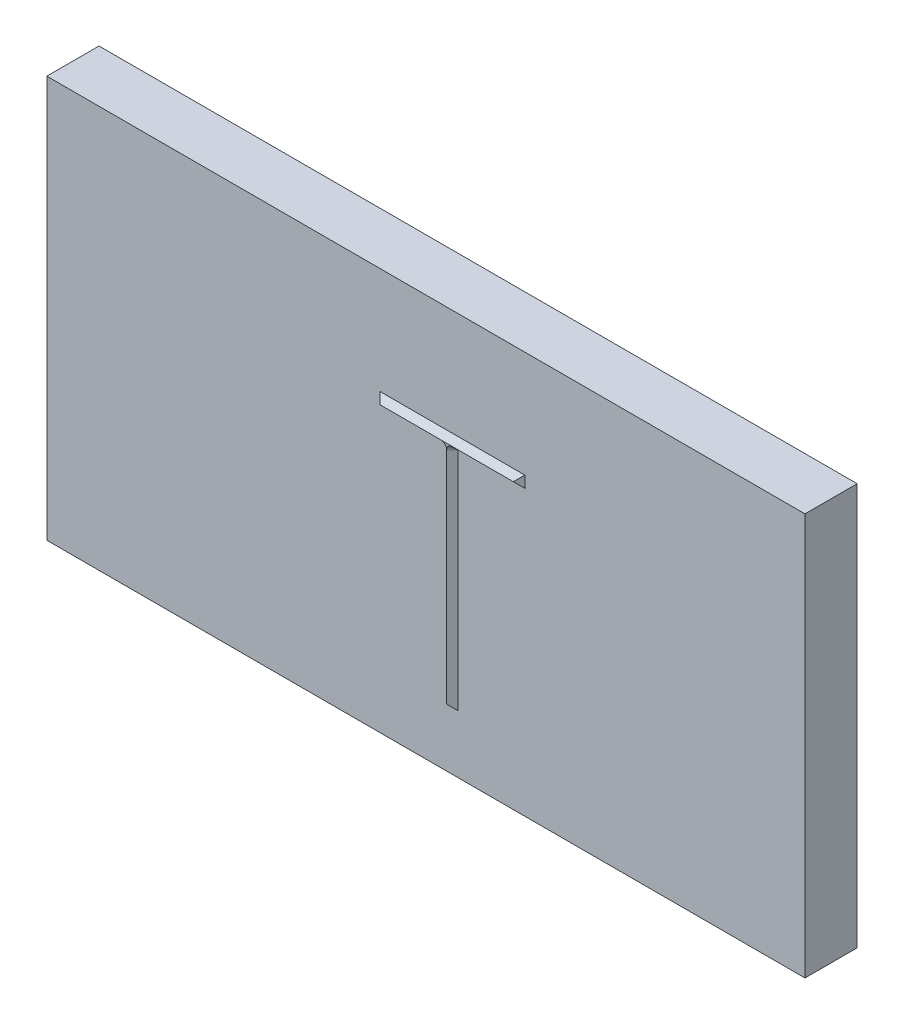
ISO-10303-21;
HEADER;
FILE_DESCRIPTION(('STEP AP214'),'2;1');
FILE_NAME('part.step','',(''),(''),'','','');
FILE_SCHEMA(('AUTOMOTIVE_DESIGN { 1 0 10303 214 1 1 1 1 }'));
ENDSEC;
DATA;
#1=APPLICATION_CONTEXT('core data for automotive mechanical design processes');
#2=APPLICATION_PROTOCOL_DEFINITION('international standard','automotive_design',2000,#1);
#3=PRODUCT_CONTEXT('',#1,'mechanical');
#4=PRODUCT('Part','Part','',(#3));
#5=PRODUCT_RELATED_PRODUCT_CATEGORY('part','',(#4));
#6=PRODUCT_DEFINITION_FORMATION('','',#4);
#7=PRODUCT_DEFINITION_CONTEXT('part definition',#1,'design');
#8=PRODUCT_DEFINITION('design','',#6,#7);
#9=PRODUCT_DEFINITION_SHAPE('','',#8);
#10=(LENGTH_UNIT() NAMED_UNIT(*) SI_UNIT(.MILLI.,.METRE.));
#11=(NAMED_UNIT(*) PLANE_ANGLE_UNIT() SI_UNIT($,.RADIAN.));
#12=(NAMED_UNIT(*) SI_UNIT($,.STERADIAN.) SOLID_ANGLE_UNIT());
#13=UNCERTAINTY_MEASURE_WITH_UNIT(LENGTH_MEASURE(1.E-05),#10,'distance_accuracy_value','');
#14=(GEOMETRIC_REPRESENTATION_CONTEXT(3) GLOBAL_UNCERTAINTY_ASSIGNED_CONTEXT((#13)) GLOBAL_UNIT_ASSIGNED_CONTEXT((#10,
#11,#12)) REPRESENTATION_CONTEXT('',''));
#15=CARTESIAN_POINT('',(0.,0.,0.));
#16=DIRECTION('',(0.,0.,1.));
#17=DIRECTION('',(1.,0.,0.));
#18=AXIS2_PLACEMENT_3D('',#15,#16,#17);
#19=CARTESIAN_POINT('',(69.01,10.,9.01));
#20=DIRECTION('',(0.707106781186551,0.,-0.707106781186544));
#21=DIRECTION('',(-0.707106781186544,0.,-0.707106781186551));
#22=AXIS2_PLACEMENT_3D('',#19,#20,#21);
#23=PLANE('',#22);
#24=DIRECTION('',(-0.577350269189624,-0.577350269189624,-0.57735026918963));
#25=VECTOR('',#24,1.);
#26=CARTESIAN_POINT('',(69.0066666666667,10.0066666666667,9.00666666666666));
#27=LINE('',#26,#25);
#28=CARTESIAN_POINT('',(70.,11.,10.));
#29=VERTEX_POINT('',#28);
#30=CARTESIAN_POINT('',(69.01,10.01,9.01));
#31=VERTEX_POINT('',#30);
#32=EDGE_CURVE('E405',#29,#31,#27,.T.);
#33=ORIENTED_EDGE('',*,*,#32,.F.);
#34=DIRECTION('',(0.,1.,0.));
#35=VECTOR('',#34,1.);
#36=CARTESIAN_POINT('',(70.,10.,10.));
#37=LINE('',#36,#35);
#38=CARTESIAN_POINT('',(70.,49.,10.));
#39=VERTEX_POINT('',#38);
#40=EDGE_CURVE('E322',#29,#39,#37,.T.);
#41=ORIENTED_EDGE('',*,*,#40,.T.);
#42=CARTESIAN_POINT('',(70.,49.,10.));
#43=DIRECTION('',(-0.707106781186544,0.,-0.707106781186551));
#44=VECTOR('',#43,1.);
#45=LINE('',#42,#44);
#46=CARTESIAN_POINT('',(69.01,49.,9.01));
#47=VERTEX_POINT('',#46);
#48=EDGE_CURVE('E441',#39,#47,#45,.T.);
#49=ORIENTED_EDGE('',*,*,#48,.T.);
#50=DIRECTION('',(0.,1.,0.));
#51=VECTOR('',#50,1.);
#52=CARTESIAN_POINT('',(69.01,10.,9.01));
#53=LINE('',#52,#51);
#54=EDGE_CURVE('E95',#31,#47,#53,.T.);
#55=ORIENTED_EDGE('',*,*,#54,.F.);
#56=EDGE_LOOP('',(#33,#41,#49,#55));
#57=FACE_BOUND('',#56,.T.);
#58=ADVANCED_FACE('F91',(#57),#23,.F.);
#59=CARTESIAN_POINT('',(70.99,10.,9.01));
#60=DIRECTION('',(0.707106781186551,0.,0.707106781186544));
#61=DIRECTION('',(0.707106781186544,0.,-0.707106781186551));
#62=AXIS2_PLACEMENT_3D('',#59,#60,#61);
#63=PLANE('',#62);
#64=ORIENTED_EDGE('',*,*,#40,.F.);
#65=DIRECTION('',(0.577350269189624,-0.577350269189624,-0.57735026918963));
#66=VECTOR('',#65,1.);
#67=CARTESIAN_POINT('',(70.9933333333333,10.0066666666667,9.00666666666666));
#68=LINE('',#67,#66);
#69=CARTESIAN_POINT('',(70.99,10.01,9.01));
#70=VERTEX_POINT('',#69);
#71=EDGE_CURVE('E13',#29,#70,#68,.T.);
#72=ORIENTED_EDGE('',*,*,#71,.T.);
#73=DIRECTION('',(0.,1.,0.));
#74=VECTOR('',#73,1.);
#75=CARTESIAN_POINT('',(70.99,10.,9.01));
#76=LINE('',#75,#74);
#77=CARTESIAN_POINT('',(70.99,49.,9.01));
#78=VERTEX_POINT('',#77);
#79=EDGE_CURVE('E324',#70,#78,#76,.T.);
#80=ORIENTED_EDGE('',*,*,#79,.T.);
#81=CARTESIAN_POINT('',(70.,48.9999999999977,10.));
#82=DIRECTION('',(0.707106781186544,1.62064467799746E-12,-0.707106781186551));
#83=VECTOR('',#82,1.);
#84=LINE('',#81,#83);
#85=EDGE_CURVE('E326',#39,#78,#84,.T.);
#86=ORIENTED_EDGE('',*,*,#85,.F.);
#87=EDGE_LOOP('',(#64,#72,#80,#86));
#88=FACE_BOUND('',#87,.T.);
#89=ADVANCED_FACE('F237',(#88),#63,.T.);
#90=CARTESIAN_POINT('',(0.,0.,10.));
#91=DIRECTION('',(0.,0.,-1.));
#92=DIRECTION('',(-1.,0.,0.));
#93=AXIS2_PLACEMENT_3D('',#90,#91,#92);
#94=PLANE('',#93);
#95=CARTESIAN_POINT('',(71.,49.,10.));
#96=DIRECTION('',(0.,0.,1.));
#97=DIRECTION('',(-5.00129789388072E-05,0.999999998749351,0.));
#98=AXIS2_PLACEMENT_3D('',#95,#96,#97);
#99=CIRCLE('',#98,0.999999999999998);
#100=CARTESIAN_POINT('',(70.9999749935106,50.,10.));
#101=VERTEX_POINT('',#100);
#102=EDGE_CURVE('E259',#101,#39,#99,.T.);
#103=ORIENTED_EDGE('',*,*,#102,.F.);
#104=DIRECTION('',(1.,0.,0.));
#105=VECTOR('',#104,1.);
#106=CARTESIAN_POINT('',(57.5,50.,10.));
#107=LINE('',#106,#105);
#108=CARTESIAN_POINT('',(68.9998884489562,50.,10.));
#109=VERTEX_POINT('',#108);
#110=EDGE_CURVE('E413',#109,#101,#107,.T.);
#111=ORIENTED_EDGE('',*,*,#110,.F.);
#112=CARTESIAN_POINT('',(69.,49.,10.));
#113=DIRECTION('',(0.,0.,1.));
#114=DIRECTION('',(1.,0.,0.));
#115=AXIS2_PLACEMENT_3D('',#112,#113,#114);
#116=CIRCLE('',#115,1.);
#117=EDGE_CURVE('E219',#39,#109,#116,.T.);
#118=ORIENTED_EDGE('',*,*,#117,.F.);
#119=EDGE_LOOP('',(#103,#111,#118));
#120=FACE_BOUND('',#119,.T.);
#121=ADVANCED_FACE('F226',(#120),#94,.F.);
#122=CARTESIAN_POINT('',(71.,49.01,9.01));
#123=DIRECTION('',(0.,-0.707106781186551,0.707106781186544));
#124=DIRECTION('',(0.,-0.707106781186544,-0.707106781186551));
#125=AXIS2_PLACEMENT_3D('',#122,#123,#124);
#126=PLANE('',#125);
#127=DIRECTION('',(1.,0.,0.));
#128=VECTOR('',#127,1.);
#129=CARTESIAN_POINT('',(71.,49.01,9.01));
#130=LINE('',#129,#128);
#131=CARTESIAN_POINT('',(71.,49.01,9.01));
#132=VERTEX_POINT('',#131);
#133=CARTESIAN_POINT('',(82.49,49.01,9.01));
#134=VERTEX_POINT('',#133);
#135=EDGE_CURVE('E423',#132,#134,#130,.T.);
#136=ORIENTED_EDGE('',*,*,#135,.T.);
#137=DIRECTION('',(-0.577350269189624,0.577350269189624,0.57735026918963));
#138=VECTOR('',#137,1.);
#139=CARTESIAN_POINT('',(78.66,52.84,12.84));
#140=LINE('',#139,#138);
#141=CARTESIAN_POINT('',(81.5,50.,10.));
#142=VERTEX_POINT('',#141);
#143=EDGE_CURVE('E207',#134,#142,#140,.T.);
#144=ORIENTED_EDGE('',*,*,#143,.T.);
#145=DIRECTION('',(1.,0.,0.));
#146=VECTOR('',#145,1.);
#147=CARTESIAN_POINT('',(71.,50.,10.));
#148=LINE('',#147,#146);
#149=EDGE_CURVE('E424',#101,#142,#148,.T.);
#150=ORIENTED_EDGE('',*,*,#149,.F.);
#151=CARTESIAN_POINT('',(71.,50.,10.));
#152=DIRECTION('',(0.,-0.707106781186544,-0.707106781186551));
#153=VECTOR('',#152,1.);
#154=LINE('',#151,#153);
#155=EDGE_CURVE('E116',#101,#132,#154,.T.);
#156=ORIENTED_EDGE('',*,*,#155,.T.);
#157=EDGE_LOOP('',(#136,#144,#150,#156));
#158=FACE_BOUND('',#157,.T.);
#159=ADVANCED_FACE('F236',(#158),#126,.T.);
#160=CARTESIAN_POINT('',(71.,49.,10.));
#161=DIRECTION('',(0.,0.,1.));
#162=DIRECTION('',(0.,-1.,0.));
#163=AXIS2_PLACEMENT_3D('',#160,#161,#162);
#164=CONICAL_SURFACE('',#163,1.,0.785398163397444);
#165=CARTESIAN_POINT('',(70.99,49.,9.01));
#166=CARTESIAN_POINT('',(70.99,48.98,9.01));
#167=CARTESIAN_POINT('',(71.01,48.98,9.01));
#168=CARTESIAN_POINT('',(71.01,49.,9.01));
#169=CARTESIAN_POINT('',(71.01,49.02,9.01));
#170=CARTESIAN_POINT('',(70.99,49.02,9.01));
#171=CARTESIAN_POINT('',(70.99,49.,9.01));
#172=(BOUNDED_CURVE() B_SPLINE_CURVE(3,(#165,#166,#167,#168,#169,#170,#171),.UNSPECIFIED.,.T.,
.F.) B_SPLINE_CURVE_WITH_KNOTS((4,3,4),(0.,0.5,1.),
.UNSPECIFIED.) CURVE() GEOMETRIC_REPRESENTATION_ITEM() RATIONAL_B_SPLINE_CURVE((1.,
0.333333333333333,0.333333333333333,1.,0.333333333333333,0.333333333333333,1.)) REPRESENTATION_ITEM(''));
#173=EDGE_CURVE('E248',#132,#78,#172,.T.);
#174=ORIENTED_EDGE('',*,*,#173,.F.);
#175=ORIENTED_EDGE('',*,*,#155,.F.);
#176=ORIENTED_EDGE('',*,*,#102,.T.);
#177=ORIENTED_EDGE('',*,*,#85,.T.);
#178=EDGE_LOOP('',(#174,#175,#176,#177));
#179=FACE_BOUND('',#178,.T.);
#180=ADVANCED_FACE('F269',(#179),#164,.F.);
#181=CARTESIAN_POINT('',(69.,49.,10.));
#182=DIRECTION('',(0.,0.,1.));
#183=DIRECTION('',(0.,-1.,0.));
#184=AXIS2_PLACEMENT_3D('',#181,#182,#183);
#185=CONICAL_SURFACE('',#184,1.,0.785398163397444);
#186=CARTESIAN_POINT('',(69.,50.,10.));
#187=DIRECTION('',(0.,-0.707106781186545,-0.70710678118655));
#188=VECTOR('',#187,1.);
#189=LINE('',#186,#188);
#190=CARTESIAN_POINT('',(69.,49.01,9.01));
#191=VERTEX_POINT('',#190);
#192=EDGE_CURVE('E314',#109,#191,#189,.T.);
#193=ORIENTED_EDGE('',*,*,#192,.T.);
#194=CARTESIAN_POINT('',(69.01,49.,9.01));
#195=CARTESIAN_POINT('',(69.01,49.02,9.01));
#196=CARTESIAN_POINT('',(68.99,49.02,9.01));
#197=CARTESIAN_POINT('',(68.99,49.,9.01));
#198=CARTESIAN_POINT('',(68.99,48.98,9.01));
#199=CARTESIAN_POINT('',(69.01,48.98,9.01));
#200=CARTESIAN_POINT('',(69.01,49.,9.01));
#201=(BOUNDED_CURVE() B_SPLINE_CURVE(3,(#194,#195,#196,#197,#198,#199,#200),.UNSPECIFIED.,.T.,
.F.) B_SPLINE_CURVE_WITH_KNOTS((4,3,4),(0.,0.5,1.),
.UNSPECIFIED.) CURVE() GEOMETRIC_REPRESENTATION_ITEM() RATIONAL_B_SPLINE_CURVE((1.,
0.333333333333333,0.333333333333333,1.,0.333333333333333,0.333333333333333,1.)) REPRESENTATION_ITEM(''));
#202=EDGE_CURVE('E445',#47,#191,#201,.T.);
#203=ORIENTED_EDGE('',*,*,#202,.F.);
#204=ORIENTED_EDGE('',*,*,#48,.F.);
#205=ORIENTED_EDGE('',*,*,#117,.T.);
#206=EDGE_LOOP('',(#193,#203,#204,#205));
#207=FACE_BOUND('',#206,.T.);
#208=ADVANCED_FACE('F238',(#207),#185,.F.);
#209=CARTESIAN_POINT('',(69.,10.,9.01));
#210=DIRECTION('',(0.,0.,1.));
#211=DIRECTION('',(1.,0.,0.));
#212=AXIS2_PLACEMENT_3D('',#209,#210,#211);
#213=PLANE('',#212);
#214=DIRECTION('',(1.,0.,0.));
#215=VECTOR('',#214,1.);
#216=CARTESIAN_POINT('',(69.,10.01,9.01));
#217=LINE('',#216,#215);
#218=EDGE_CURVE('E191',#31,#70,#217,.T.);
#219=ORIENTED_EDGE('',*,*,#218,.F.);
#220=ORIENTED_EDGE('',*,*,#54,.T.);
#221=ORIENTED_EDGE('',*,*,#202,.T.);
#222=DIRECTION('',(-1.,0.,0.));
#223=VECTOR('',#222,1.);
#224=CARTESIAN_POINT('',(69.,49.01,9.01));
#225=LINE('',#224,#223);
#226=CARTESIAN_POINT('',(57.51,49.01,9.01));
#227=VERTEX_POINT('',#226);
#228=EDGE_CURVE('E305',#191,#227,#225,.T.);
#229=ORIENTED_EDGE('',*,*,#228,.T.);
#230=DIRECTION('',(0.,1.,0.));
#231=VECTOR('',#230,1.);
#232=CARTESIAN_POINT('',(57.51,49.,9.01));
#233=LINE('',#232,#231);
#234=CARTESIAN_POINT('',(57.51,50.99,9.01));
#235=VERTEX_POINT('',#234);
#236=EDGE_CURVE('E302',#227,#235,#233,.T.);
#237=ORIENTED_EDGE('',*,*,#236,.T.);
#238=DIRECTION('',(1.,0.,0.));
#239=VECTOR('',#238,1.);
#240=CARTESIAN_POINT('',(57.5,50.99,9.01));
#241=LINE('',#240,#239);
#242=CARTESIAN_POINT('',(82.49,50.99,9.01));
#243=VERTEX_POINT('',#242);
#244=EDGE_CURVE('E407',#235,#243,#241,.T.);
#245=ORIENTED_EDGE('',*,*,#244,.T.);
#246=DIRECTION('',(0.,1.,0.));
#247=VECTOR('',#246,1.);
#248=CARTESIAN_POINT('',(82.49,49.,9.01));
#249=LINE('',#248,#247);
#250=EDGE_CURVE('E418',#134,#243,#249,.T.);
#251=ORIENTED_EDGE('',*,*,#250,.F.);
#252=ORIENTED_EDGE('',*,*,#135,.F.);
#253=ORIENTED_EDGE('',*,*,#173,.T.);
#254=ORIENTED_EDGE('',*,*,#79,.F.);
#255=EDGE_LOOP('',(#219,#220,#221,#229,#237,#245,#251,#252,#253,#254));
#256=FACE_BOUND('',#255,.T.);
#257=DIRECTION('',(1.,0.,0.));
#258=VECTOR('',#257,1.);
#259=CARTESIAN_POINT('',(130.844862561268,69.372082704697,9.00999999999999));
#260=LINE('',#259,#258);
#261=CARTESIAN_POINT('',(0.,69.372082704697,9.00999999999999));
#262=VERTEX_POINT('',#261);
#263=CARTESIAN_POINT('',(130.844862561268,69.372082704697,9.01));
#264=VERTEX_POINT('',#263);
#265=EDGE_CURVE('E187',#262,#264,#260,.T.);
#266=ORIENTED_EDGE('',*,*,#265,.F.);
#267=DIRECTION('',(0.,1.,0.));
#268=VECTOR('',#267,1.);
#269=CARTESIAN_POINT('',(0.,69.372082704697,9.00999999999999));
#270=LINE('',#269,#268);
#271=CARTESIAN_POINT('',(0.,0.,9.00999999999999));
#272=VERTEX_POINT('',#271);
#273=EDGE_CURVE('E183',#272,#262,#270,.T.);
#274=ORIENTED_EDGE('',*,*,#273,.F.);
#275=DIRECTION('',(-1.,0.,0.));
#276=VECTOR('',#275,1.);
#277=CARTESIAN_POINT('',(0.,0.,9.00999999999999));
#278=LINE('',#277,#276);
#279=CARTESIAN_POINT('',(130.844862561268,0.,9.00999999999999));
#280=VERTEX_POINT('',#279);
#281=EDGE_CURVE('E186',#280,#272,#278,.T.);
#282=ORIENTED_EDGE('',*,*,#281,.F.);
#283=DIRECTION('',(0.,-1.,0.));
#284=VECTOR('',#283,1.);
#285=CARTESIAN_POINT('',(130.844862561268,0.,9.00999999999999));
#286=LINE('',#285,#284);
#287=EDGE_CURVE('E108',#264,#280,#286,.T.);
#288=ORIENTED_EDGE('',*,*,#287,.F.);
#289=EDGE_LOOP('',(#266,#274,#282,#288));
#290=FACE_BOUND('',#289,.T.);
#291=ADVANCED_FACE('F185',(#256,#290),#213,.T.);
#292=CARTESIAN_POINT('',(69.,49.01,9.01));
#293=DIRECTION('',(0.,0.707106781186551,-0.707106781186544));
#294=DIRECTION('',(0.,0.707106781186544,0.707106781186551));
#295=AXIS2_PLACEMENT_3D('',#292,#293,#294);
#296=PLANE('',#295);
#297=DIRECTION('',(-1.,0.,0.));
#298=VECTOR('',#297,1.);
#299=CARTESIAN_POINT('',(69.,50.,10.));
#300=LINE('',#299,#298);
#301=CARTESIAN_POINT('',(58.5,50.,10.));
#302=VERTEX_POINT('',#301);
#303=EDGE_CURVE('E310',#109,#302,#300,.T.);
#304=ORIENTED_EDGE('',*,*,#303,.T.);
#305=DIRECTION('',(-0.577350269189624,-0.577350269189624,-0.57735026918963));
#306=VECTOR('',#305,1.);
#307=CARTESIAN_POINT('',(61.34,52.84,12.84));
#308=LINE('',#307,#306);
#309=EDGE_CURVE('E204',#302,#227,#308,.T.);
#310=ORIENTED_EDGE('',*,*,#309,.T.);
#311=ORIENTED_EDGE('',*,*,#228,.F.);
#312=ORIENTED_EDGE('',*,*,#192,.F.);
#313=EDGE_LOOP('',(#304,#310,#311,#312));
#314=FACE_BOUND('',#313,.T.);
#315=ADVANCED_FACE('F472',(#314),#296,.F.);
#316=CARTESIAN_POINT('',(57.51,49.,9.01));
#317=DIRECTION('',(0.707106781186551,0.,-0.707106781186544));
#318=DIRECTION('',(-0.707106781186544,0.,-0.707106781186551));
#319=AXIS2_PLACEMENT_3D('',#316,#317,#318);
#320=PLANE('',#319);
#321=ORIENTED_EDGE('',*,*,#309,.F.);
#322=DIRECTION('',(-0.577350269189623,0.577350269189626,-0.577350269189629));
#323=VECTOR('',#322,1.);
#324=CARTESIAN_POINT('',(58.1733333333333,50.3266666666667,9.67333333333333));
#325=LINE('',#324,#323);
#326=EDGE_CURVE('E415',#302,#235,#325,.T.);
#327=ORIENTED_EDGE('',*,*,#326,.T.);
#328=ORIENTED_EDGE('',*,*,#236,.F.);
#329=EDGE_LOOP('',(#321,#327,#328));
#330=FACE_BOUND('',#329,.T.);
#331=ADVANCED_FACE('F281',(#330),#320,.F.);
#332=CARTESIAN_POINT('',(82.49,49.,9.01));
#333=DIRECTION('',(0.707106781186551,0.,0.707106781186544));
#334=DIRECTION('',(0.707106781186544,0.,-0.707106781186551));
#335=AXIS2_PLACEMENT_3D('',#332,#333,#334);
#336=PLANE('',#335);
#337=DIRECTION('',(0.577350269189623,0.577350269189626,-0.577350269189629));
#338=VECTOR('',#337,1.);
#339=CARTESIAN_POINT('',(81.8266666666667,50.3266666666667,9.67333333333333));
#340=LINE('',#339,#338);
#341=EDGE_CURVE('E101',#142,#243,#340,.T.);
#342=ORIENTED_EDGE('',*,*,#341,.F.);
#343=ORIENTED_EDGE('',*,*,#143,.F.);
#344=ORIENTED_EDGE('',*,*,#250,.T.);
#345=EDGE_LOOP('',(#342,#343,#344));
#346=FACE_BOUND('',#345,.T.);
#347=ADVANCED_FACE('F346',(#346),#336,.T.);
#348=CARTESIAN_POINT('',(57.5,50.99,9.01));
#349=DIRECTION('',(0.,-0.707106781186549,-0.707106781186546));
#350=DIRECTION('',(0.,0.707106781186546,-0.707106781186549));
#351=AXIS2_PLACEMENT_3D('',#348,#349,#350);
#352=PLANE('',#351);
#353=ORIENTED_EDGE('',*,*,#303,.F.);
#354=ORIENTED_EDGE('',*,*,#110,.T.);
#355=ORIENTED_EDGE('',*,*,#149,.T.);
#356=ORIENTED_EDGE('',*,*,#341,.T.);
#357=ORIENTED_EDGE('',*,*,#244,.F.);
#358=ORIENTED_EDGE('',*,*,#326,.F.);
#359=EDGE_LOOP('',(#353,#354,#355,#356,#357,#358));
#360=FACE_BOUND('',#359,.T.);
#361=ADVANCED_FACE('F349',(#360),#352,.F.);
#362=CARTESIAN_POINT('',(69.,10.01,9.01));
#363=DIRECTION('',(0.,-0.707106781186551,0.707106781186544));
#364=DIRECTION('',(0.,-0.707106781186544,-0.707106781186551));
#365=AXIS2_PLACEMENT_3D('',#362,#363,#364);
#366=PLANE('',#365);
#367=ORIENTED_EDGE('',*,*,#32,.T.);
#368=ORIENTED_EDGE('',*,*,#218,.T.);
#369=ORIENTED_EDGE('',*,*,#71,.F.);
#370=EDGE_LOOP('',(#367,#368,#369));
#371=FACE_BOUND('',#370,.T.);
#372=ADVANCED_FACE('F353',(#371),#366,.T.);
#373=CARTESIAN_POINT('',(0.,0.,0.));
#374=DIRECTION('',(0.,0.,-1.));
#375=DIRECTION('',(-1.,0.,0.));
#376=AXIS2_PLACEMENT_3D('',#373,#374,#375);
#377=PLANE('',#376);
#378=DIRECTION('',(0.,-1.,0.));
#379=VECTOR('',#378,1.);
#380=CARTESIAN_POINT('',(0.,0.,0.));
#381=LINE('',#380,#379);
#382=CARTESIAN_POINT('',(0.,69.372082704697,0.));
#383=VERTEX_POINT('',#382);
#384=CARTESIAN_POINT('',(0.,0.,0.));
#385=VERTEX_POINT('',#384);
#386=EDGE_CURVE('E203',#383,#385,#381,.T.);
#387=ORIENTED_EDGE('',*,*,#386,.F.);
#388=DIRECTION('',(-1.,0.,0.));
#389=VECTOR('',#388,1.);
#390=CARTESIAN_POINT('',(0.,69.372082704697,0.));
#391=LINE('',#390,#389);
#392=CARTESIAN_POINT('',(130.844862561268,69.372082704697,0.));
#393=VERTEX_POINT('',#392);
#394=EDGE_CURVE('E389',#393,#383,#391,.T.);
#395=ORIENTED_EDGE('',*,*,#394,.F.);
#396=DIRECTION('',(0.,1.,0.));
#397=VECTOR('',#396,1.);
#398=CARTESIAN_POINT('',(130.844862561268,0.,0.));
#399=LINE('',#398,#397);
#400=CARTESIAN_POINT('',(130.844862561268,0.,0.));
#401=VERTEX_POINT('',#400);
#402=EDGE_CURVE('E386',#401,#393,#399,.T.);
#403=ORIENTED_EDGE('',*,*,#402,.F.);
#404=DIRECTION('',(1.,0.,0.));
#405=VECTOR('',#404,1.);
#406=CARTESIAN_POINT('',(0.,0.,0.));
#407=LINE('',#406,#405);
#408=EDGE_CURVE('E384',#385,#401,#407,.T.);
#409=ORIENTED_EDGE('',*,*,#408,.F.);
#410=EDGE_LOOP('',(#387,#395,#403,#409));
#411=FACE_BOUND('',#410,.T.);
#412=ADVANCED_FACE('F241',(#411),#377,.T.);
#413=CARTESIAN_POINT('',(0.,69.372082704697,10.));
#414=DIRECTION('',(0.,-1.,0.));
#415=DIRECTION('',(0.,0.,-1.));
#416=AXIS2_PLACEMENT_3D('',#413,#414,#415);
#417=PLANE('',#416);
#418=ORIENTED_EDGE('',*,*,#265,.T.);
#419=DIRECTION('',(0.,0.,-1.));
#420=VECTOR('',#419,1.);
#421=CARTESIAN_POINT('',(130.844862561268,69.372082704697,10.));
#422=LINE('',#421,#420);
#423=EDGE_CURVE('E209',#264,#393,#422,.T.);
#424=ORIENTED_EDGE('',*,*,#423,.T.);
#425=ORIENTED_EDGE('',*,*,#394,.T.);
#426=DIRECTION('',(0.,0.,-1.));
#427=VECTOR('',#426,1.);
#428=CARTESIAN_POINT('',(0.,69.372082704697,10.));
#429=LINE('',#428,#427);
#430=EDGE_CURVE('E392',#262,#383,#429,.T.);
#431=ORIENTED_EDGE('',*,*,#430,.F.);
#432=EDGE_LOOP('',(#418,#424,#425,#431));
#433=FACE_BOUND('',#432,.T.);
#434=ADVANCED_FACE('F360',(#433),#417,.F.);
#435=CARTESIAN_POINT('',(130.844862561268,0.,10.));
#436=DIRECTION('',(-1.,0.,0.));
#437=DIRECTION('',(0.,0.,1.));
#438=AXIS2_PLACEMENT_3D('',#435,#436,#437);
#439=PLANE('',#438);
#440=ORIENTED_EDGE('',*,*,#287,.T.);
#441=DIRECTION('',(0.,0.,-1.));
#442=VECTOR('',#441,1.);
#443=CARTESIAN_POINT('',(130.844862561268,0.,10.));
#444=LINE('',#443,#442);
#445=EDGE_CURVE('E199',#280,#401,#444,.T.);
#446=ORIENTED_EDGE('',*,*,#445,.T.);
#447=ORIENTED_EDGE('',*,*,#402,.T.);
#448=ORIENTED_EDGE('',*,*,#423,.F.);
#449=EDGE_LOOP('',(#440,#446,#447,#448));
#450=FACE_BOUND('',#449,.T.);
#451=ADVANCED_FACE('F398',(#450),#439,.F.);
#452=CARTESIAN_POINT('',(0.,0.,10.));
#453=DIRECTION('',(0.,1.,0.));
#454=DIRECTION('',(0.,0.,1.));
#455=AXIS2_PLACEMENT_3D('',#452,#453,#454);
#456=PLANE('',#455);
#457=ORIENTED_EDGE('',*,*,#281,.T.);
#458=DIRECTION('',(0.,0.,-1.));
#459=VECTOR('',#458,1.);
#460=CARTESIAN_POINT('',(0.,0.,10.));
#461=LINE('',#460,#459);
#462=EDGE_CURVE('E197',#272,#385,#461,.T.);
#463=ORIENTED_EDGE('',*,*,#462,.T.);
#464=ORIENTED_EDGE('',*,*,#408,.T.);
#465=ORIENTED_EDGE('',*,*,#445,.F.);
#466=EDGE_LOOP('',(#457,#463,#464,#465));
#467=FACE_BOUND('',#466,.T.);
#468=ADVANCED_FACE('F195',(#467),#456,.F.);
#469=CARTESIAN_POINT('',(0.,0.,10.));
#470=DIRECTION('',(1.,0.,0.));
#471=DIRECTION('',(0.,0.,-1.));
#472=AXIS2_PLACEMENT_3D('',#469,#470,#471);
#473=PLANE('',#472);
#474=ORIENTED_EDGE('',*,*,#273,.T.);
#475=ORIENTED_EDGE('',*,*,#430,.T.);
#476=ORIENTED_EDGE('',*,*,#386,.T.);
#477=ORIENTED_EDGE('',*,*,#462,.F.);
#478=EDGE_LOOP('',(#474,#475,#476,#477));
#479=FACE_BOUND('',#478,.T.);
#480=ADVANCED_FACE('F93',(#479),#473,.F.);
#481=CLOSED_SHELL('',(#58,#89,#121,#159,#180,#208,#291,#315,#331,#347,#361,#372,#412,#434,#451,
#468,#480));
#482=MANIFOLD_SOLID_BREP('B2',#481);
#483=ADVANCED_BREP_SHAPE_REPRESENTATION('',(#18,#482),#14);
#484=SHAPE_DEFINITION_REPRESENTATION(#9,#483);
ENDSEC;
END-ISO-10303-21;
